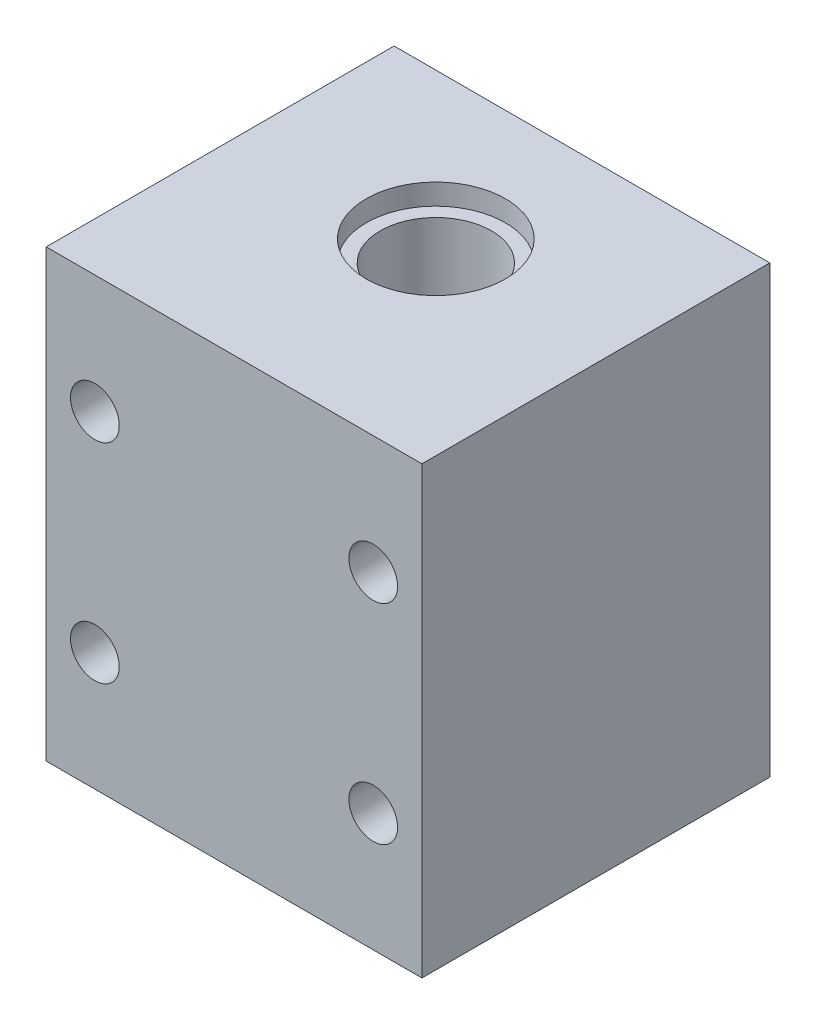
ISO-10303-21;
HEADER;
FILE_DESCRIPTION(('STEP AP214'),'2;1');
FILE_NAME('part.step','',(''),(''),'','','');
FILE_SCHEMA(('AUTOMOTIVE_DESIGN { 1 0 10303 214 1 1 1 1 }'));
ENDSEC;
DATA;
#1=APPLICATION_CONTEXT('core data for automotive mechanical design processes');
#2=APPLICATION_PROTOCOL_DEFINITION('international standard','automotive_design',2000,#1);
#3=PRODUCT_CONTEXT('',#1,'mechanical');
#4=PRODUCT('Part','Part','',(#3));
#5=PRODUCT_RELATED_PRODUCT_CATEGORY('part','',(#4));
#6=PRODUCT_DEFINITION_FORMATION('','',#4);
#7=PRODUCT_DEFINITION_CONTEXT('part definition',#1,'design');
#8=PRODUCT_DEFINITION('design','',#6,#7);
#9=PRODUCT_DEFINITION_SHAPE('','',#8);
#10=(LENGTH_UNIT() NAMED_UNIT(*) SI_UNIT(.MILLI.,.METRE.));
#11=(NAMED_UNIT(*) PLANE_ANGLE_UNIT() SI_UNIT($,.RADIAN.));
#12=(NAMED_UNIT(*) SI_UNIT($,.STERADIAN.) SOLID_ANGLE_UNIT());
#13=UNCERTAINTY_MEASURE_WITH_UNIT(LENGTH_MEASURE(1.E-05),#10,'distance_accuracy_value','');
#14=(GEOMETRIC_REPRESENTATION_CONTEXT(3) GLOBAL_UNCERTAINTY_ASSIGNED_CONTEXT((#13)) GLOBAL_UNIT_ASSIGNED_CONTEXT((#10,
#11,#12)) REPRESENTATION_CONTEXT('',''));
#15=CARTESIAN_POINT('',(0.,0.,0.));
#16=DIRECTION('',(0.,0.,1.));
#17=DIRECTION('',(1.,0.,0.));
#18=AXIS2_PLACEMENT_3D('',#15,#16,#17);
#19=CARTESIAN_POINT('',(0.,-16.,16.5));
#20=DIRECTION('',(0.,1.,0.));
#21=DIRECTION('',(0.,0.,1.));
#22=AXIS2_PLACEMENT_3D('',#19,#20,#21);
#23=CYLINDRICAL_SURFACE('',#22,4.);
#24=CARTESIAN_POINT('',(0.,14.5,16.5));
#25=DIRECTION('',(0.,1.,0.));
#26=DIRECTION('',(0.,0.,1.));
#27=AXIS2_PLACEMENT_3D('',#24,#25,#26);
#28=CIRCLE('',#27,4.);
#29=CARTESIAN_POINT('',(0.,14.5,20.5));
#30=VERTEX_POINT('',#29);
#31=EDGE_CURVE('E104',#30,#30,#28,.T.);
#32=ORIENTED_EDGE('',*,*,#31,.T.);
#33=EDGE_LOOP('',(#32));
#34=FACE_BOUND('',#33,.T.);
#35=CARTESIAN_POINT('',(0.,-14.5,16.5));
#36=DIRECTION('',(0.,-1.,0.));
#37=DIRECTION('',(0.,0.,-1.));
#38=AXIS2_PLACEMENT_3D('',#35,#36,#37);
#39=CIRCLE('',#38,4.);
#40=CARTESIAN_POINT('',(0.,-14.5,12.5));
#41=VERTEX_POINT('',#40);
#42=EDGE_CURVE('E38',#41,#41,#39,.F.);
#43=ORIENTED_EDGE('',*,*,#42,.F.);
#44=EDGE_LOOP('',(#43));
#45=FACE_BOUND('',#44,.T.);
#46=ADVANCED_FACE('F34',(#34,#45),#23,.F.);
#47=CARTESIAN_POINT('',(13.5,16.,31.));
#48=DIRECTION('',(-1.,0.,0.));
#49=DIRECTION('',(0.,-1.,0.));
#50=AXIS2_PLACEMENT_3D('',#47,#48,#49);
#51=PLANE('',#50);
#52=DIRECTION('',(0.,1.,0.));
#53=VECTOR('',#52,1.);
#54=CARTESIAN_POINT('',(13.5,-16.,6.));
#55=LINE('',#54,#53);
#56=CARTESIAN_POINT('',(13.5,-16.,6.));
#57=VERTEX_POINT('',#56);
#58=CARTESIAN_POINT('',(13.5,16.,6.));
#59=VERTEX_POINT('',#58);
#60=EDGE_CURVE('E51',#57,#59,#55,.T.);
#61=ORIENTED_EDGE('',*,*,#60,.T.);
#62=DIRECTION('',(0.,0.,-1.));
#63=VECTOR('',#62,1.);
#64=CARTESIAN_POINT('',(13.5,16.,31.));
#65=LINE('',#64,#63);
#66=CARTESIAN_POINT('',(13.5,16.,31.));
#67=VERTEX_POINT('',#66);
#68=EDGE_CURVE('E12',#67,#59,#65,.T.);
#69=ORIENTED_EDGE('',*,*,#68,.F.);
#70=DIRECTION('',(0.,1.,0.));
#71=VECTOR('',#70,1.);
#72=CARTESIAN_POINT('',(13.5,16.,31.));
#73=LINE('',#72,#71);
#74=CARTESIAN_POINT('',(13.5,-16.,31.));
#75=VERTEX_POINT('',#74);
#76=EDGE_CURVE('E148',#75,#67,#73,.T.);
#77=ORIENTED_EDGE('',*,*,#76,.F.);
#78=DIRECTION('',(0.,0.,-1.));
#79=VECTOR('',#78,1.);
#80=CARTESIAN_POINT('',(13.5,-16.,31.));
#81=LINE('',#80,#79);
#82=EDGE_CURVE('E96',#75,#57,#81,.T.);
#83=ORIENTED_EDGE('',*,*,#82,.T.);
#84=EDGE_LOOP('',(#61,#69,#77,#83));
#85=FACE_BOUND('',#84,.T.);
#86=ADVANCED_FACE('F36',(#85),#51,.F.);
#87=CARTESIAN_POINT('',(-13.5,16.,31.));
#88=DIRECTION('',(0.,-1.,0.));
#89=DIRECTION('',(0.,0.,-1.));
#90=AXIS2_PLACEMENT_3D('',#87,#88,#89);
#91=PLANE('',#90);
#92=CARTESIAN_POINT('',(0.,16.,16.5));
#93=DIRECTION('',(0.,1.,0.));
#94=DIRECTION('',(0.,0.,1.));
#95=AXIS2_PLACEMENT_3D('',#92,#93,#94);
#96=CIRCLE('',#95,5.);
#97=CARTESIAN_POINT('',(0.,16.,21.5));
#98=VERTEX_POINT('',#97);
#99=EDGE_CURVE('E106',#98,#98,#96,.T.);
#100=ORIENTED_EDGE('',*,*,#99,.F.);
#101=EDGE_LOOP('',(#100));
#102=FACE_BOUND('',#101,.T.);
#103=DIRECTION('',(-1.,0.,0.));
#104=VECTOR('',#103,1.);
#105=CARTESIAN_POINT('',(-13.5,16.,6.));
#106=LINE('',#105,#104);
#107=CARTESIAN_POINT('',(-13.5,16.,6.));
#108=VERTEX_POINT('',#107);
#109=EDGE_CURVE('E84',#59,#108,#106,.T.);
#110=ORIENTED_EDGE('',*,*,#109,.T.);
#111=DIRECTION('',(0.,0.,-1.));
#112=VECTOR('',#111,1.);
#113=CARTESIAN_POINT('',(-13.5,16.,31.));
#114=LINE('',#113,#112);
#115=CARTESIAN_POINT('',(-13.5,16.,31.));
#116=VERTEX_POINT('',#115);
#117=EDGE_CURVE('E43',#116,#108,#114,.T.);
#118=ORIENTED_EDGE('',*,*,#117,.F.);
#119=DIRECTION('',(-1.,0.,0.));
#120=VECTOR('',#119,1.);
#121=CARTESIAN_POINT('',(-13.5,16.,31.));
#122=LINE('',#121,#120);
#123=EDGE_CURVE('E150',#67,#116,#122,.T.);
#124=ORIENTED_EDGE('',*,*,#123,.F.);
#125=ORIENTED_EDGE('',*,*,#68,.T.);
#126=EDGE_LOOP('',(#110,#118,#124,#125));
#127=FACE_BOUND('',#126,.T.);
#128=ADVANCED_FACE('F157',(#102,#127),#91,.F.);
#129=CARTESIAN_POINT('',(-13.5,16.,31.));
#130=DIRECTION('',(1.,0.,0.));
#131=DIRECTION('',(0.,1.,0.));
#132=AXIS2_PLACEMENT_3D('',#129,#130,#131);
#133=PLANE('',#132);
#134=DIRECTION('',(0.,1.,0.));
#135=VECTOR('',#134,1.);
#136=CARTESIAN_POINT('',(-13.5,-16.,6.));
#137=LINE('',#136,#135);
#138=CARTESIAN_POINT('',(-13.5,-16.,6.));
#139=VERTEX_POINT('',#138);
#140=EDGE_CURVE('E79',#139,#108,#137,.T.);
#141=ORIENTED_EDGE('',*,*,#140,.F.);
#142=DIRECTION('',(0.,0.,-1.));
#143=VECTOR('',#142,1.);
#144=CARTESIAN_POINT('',(-13.5,-16.,31.));
#145=LINE('',#144,#143);
#146=CARTESIAN_POINT('',(-13.5,-16.,31.));
#147=VERTEX_POINT('',#146);
#148=EDGE_CURVE('E91',#147,#139,#145,.T.);
#149=ORIENTED_EDGE('',*,*,#148,.F.);
#150=DIRECTION('',(0.,-1.,0.));
#151=VECTOR('',#150,1.);
#152=CARTESIAN_POINT('',(-13.5,16.,31.));
#153=LINE('',#152,#151);
#154=EDGE_CURVE('E152',#116,#147,#153,.T.);
#155=ORIENTED_EDGE('',*,*,#154,.F.);
#156=ORIENTED_EDGE('',*,*,#117,.T.);
#157=EDGE_LOOP('',(#141,#149,#155,#156));
#158=FACE_BOUND('',#157,.T.);
#159=ADVANCED_FACE('F89',(#158),#133,.F.);
#160=CARTESIAN_POINT('',(-13.5,-16.,31.));
#161=DIRECTION('',(0.,1.,0.));
#162=DIRECTION('',(0.,0.,1.));
#163=AXIS2_PLACEMENT_3D('',#160,#161,#162);
#164=PLANE('',#163);
#165=CARTESIAN_POINT('',(0.,-16.,16.5));
#166=DIRECTION('',(0.,-1.,0.));
#167=DIRECTION('',(0.,0.,-1.));
#168=AXIS2_PLACEMENT_3D('',#165,#166,#167);
#169=CIRCLE('',#168,5.);
#170=CARTESIAN_POINT('',(0.,-16.,11.5));
#171=VERTEX_POINT('',#170);
#172=EDGE_CURVE('E117',#171,#171,#169,.T.);
#173=ORIENTED_EDGE('',*,*,#172,.F.);
#174=EDGE_LOOP('',(#173));
#175=FACE_BOUND('',#174,.T.);
#176=DIRECTION('',(-1.,0.,0.));
#177=VECTOR('',#176,1.);
#178=CARTESIAN_POINT('',(-13.5,-16.,6.));
#179=LINE('',#178,#177);
#180=EDGE_CURVE('E75',#57,#139,#179,.T.);
#181=ORIENTED_EDGE('',*,*,#180,.F.);
#182=ORIENTED_EDGE('',*,*,#82,.F.);
#183=DIRECTION('',(1.,0.,0.));
#184=VECTOR('',#183,1.);
#185=CARTESIAN_POINT('',(-13.5,-16.,31.));
#186=LINE('',#185,#184);
#187=EDGE_CURVE('E59',#147,#75,#186,.T.);
#188=ORIENTED_EDGE('',*,*,#187,.F.);
#189=ORIENTED_EDGE('',*,*,#148,.T.);
#190=EDGE_LOOP('',(#181,#182,#188,#189));
#191=FACE_BOUND('',#190,.T.);
#192=ADVANCED_FACE('F95',(#175,#191),#164,.F.);
#193=CARTESIAN_POINT('',(10.,7.5,31.));
#194=DIRECTION('',(0.,0.,-1.));
#195=DIRECTION('',(-1.,0.,0.));
#196=AXIS2_PLACEMENT_3D('',#193,#194,#195);
#197=CYLINDRICAL_SURFACE('',#196,1.75);
#198=CARTESIAN_POINT('',(10.,7.5,31.));
#199=DIRECTION('',(0.,0.,-1.));
#200=DIRECTION('',(-1.,0.,0.));
#201=AXIS2_PLACEMENT_3D('',#198,#199,#200);
#202=CIRCLE('',#201,1.75);
#203=CARTESIAN_POINT('',(8.25,7.5,31.));
#204=VERTEX_POINT('',#203);
#205=EDGE_CURVE('E140',#204,#204,#202,.T.);
#206=ORIENTED_EDGE('',*,*,#205,.F.);
#207=EDGE_LOOP('',(#206));
#208=FACE_BOUND('',#207,.T.);
#209=CARTESIAN_POINT('',(10.,7.5,6.));
#210=DIRECTION('',(0.,0.,-1.));
#211=DIRECTION('',(-1.,0.,0.));
#212=AXIS2_PLACEMENT_3D('',#209,#210,#211);
#213=CIRCLE('',#212,1.75);
#214=CARTESIAN_POINT('',(8.25,7.5,6.));
#215=VERTEX_POINT('',#214);
#216=EDGE_CURVE('E133',#215,#215,#213,.F.);
#217=ORIENTED_EDGE('',*,*,#216,.F.);
#218=EDGE_LOOP('',(#217));
#219=FACE_BOUND('',#218,.T.);
#220=ADVANCED_FACE('F188',(#208,#219),#197,.F.);
#221=CARTESIAN_POINT('',(-10.,7.5,31.));
#222=DIRECTION('',(0.,0.,-1.));
#223=DIRECTION('',(-1.,0.,0.));
#224=AXIS2_PLACEMENT_3D('',#221,#222,#223);
#225=CYLINDRICAL_SURFACE('',#224,1.75);
#226=CARTESIAN_POINT('',(-10.,7.5,31.));
#227=DIRECTION('',(0.,0.,-1.));
#228=DIRECTION('',(-1.,0.,0.));
#229=AXIS2_PLACEMENT_3D('',#226,#227,#228);
#230=CIRCLE('',#229,1.75);
#231=CARTESIAN_POINT('',(-11.75,7.5,31.));
#232=VERTEX_POINT('',#231);
#233=EDGE_CURVE('E137',#232,#232,#230,.T.);
#234=ORIENTED_EDGE('',*,*,#233,.F.);
#235=EDGE_LOOP('',(#234));
#236=FACE_BOUND('',#235,.T.);
#237=CARTESIAN_POINT('',(-10.,7.5,6.));
#238=DIRECTION('',(0.,0.,-1.));
#239=DIRECTION('',(-1.,0.,0.));
#240=AXIS2_PLACEMENT_3D('',#237,#238,#239);
#241=CIRCLE('',#240,1.75);
#242=CARTESIAN_POINT('',(-11.75,7.5,6.));
#243=VERTEX_POINT('',#242);
#244=EDGE_CURVE('E130',#243,#243,#241,.F.);
#245=ORIENTED_EDGE('',*,*,#244,.F.);
#246=EDGE_LOOP('',(#245));
#247=FACE_BOUND('',#246,.T.);
#248=ADVANCED_FACE('F184',(#236,#247),#225,.F.);
#249=CARTESIAN_POINT('',(-10.,-7.5,31.));
#250=DIRECTION('',(0.,0.,-1.));
#251=DIRECTION('',(-1.,0.,0.));
#252=AXIS2_PLACEMENT_3D('',#249,#250,#251);
#253=CYLINDRICAL_SURFACE('',#252,1.75);
#254=CARTESIAN_POINT('',(-10.,-7.5,31.));
#255=DIRECTION('',(0.,0.,-1.));
#256=DIRECTION('',(-1.,0.,0.));
#257=AXIS2_PLACEMENT_3D('',#254,#255,#256);
#258=CIRCLE('',#257,1.75);
#259=CARTESIAN_POINT('',(-11.75,-7.5,31.));
#260=VERTEX_POINT('',#259);
#261=EDGE_CURVE('E141',#260,#260,#258,.T.);
#262=ORIENTED_EDGE('',*,*,#261,.F.);
#263=EDGE_LOOP('',(#262));
#264=FACE_BOUND('',#263,.T.);
#265=CARTESIAN_POINT('',(-10.,-7.5,6.));
#266=DIRECTION('',(0.,0.,-1.));
#267=DIRECTION('',(-1.,0.,0.));
#268=AXIS2_PLACEMENT_3D('',#265,#266,#267);
#269=CIRCLE('',#268,1.75);
#270=CARTESIAN_POINT('',(-11.75,-7.5,6.));
#271=VERTEX_POINT('',#270);
#272=EDGE_CURVE('E103',#271,#271,#269,.F.);
#273=ORIENTED_EDGE('',*,*,#272,.F.);
#274=EDGE_LOOP('',(#273));
#275=FACE_BOUND('',#274,.T.);
#276=ADVANCED_FACE('F187',(#264,#275),#253,.F.);
#277=CARTESIAN_POINT('',(10.,-7.5,31.));
#278=DIRECTION('',(0.,0.,-1.));
#279=DIRECTION('',(-1.,0.,0.));
#280=AXIS2_PLACEMENT_3D('',#277,#278,#279);
#281=CYLINDRICAL_SURFACE('',#280,1.75);
#282=CARTESIAN_POINT('',(10.,-7.5,31.));
#283=DIRECTION('',(0.,0.,-1.));
#284=DIRECTION('',(-1.,0.,0.));
#285=AXIS2_PLACEMENT_3D('',#282,#283,#284);
#286=CIRCLE('',#285,1.75);
#287=CARTESIAN_POINT('',(8.25,-7.5,31.));
#288=VERTEX_POINT('',#287);
#289=EDGE_CURVE('E136',#288,#288,#286,.T.);
#290=ORIENTED_EDGE('',*,*,#289,.F.);
#291=EDGE_LOOP('',(#290));
#292=FACE_BOUND('',#291,.T.);
#293=CARTESIAN_POINT('',(10.,-7.5,6.));
#294=DIRECTION('',(0.,0.,-1.));
#295=DIRECTION('',(-1.,0.,0.));
#296=AXIS2_PLACEMENT_3D('',#293,#294,#295);
#297=CIRCLE('',#296,1.75);
#298=CARTESIAN_POINT('',(8.25,-7.5,6.));
#299=VERTEX_POINT('',#298);
#300=EDGE_CURVE('E93',#299,#299,#297,.F.);
#301=ORIENTED_EDGE('',*,*,#300,.F.);
#302=EDGE_LOOP('',(#301));
#303=FACE_BOUND('',#302,.T.);
#304=ADVANCED_FACE('F192',(#292,#303),#281,.F.);
#305=CARTESIAN_POINT('',(0.,0.,31.));
#306=DIRECTION('',(0.,0.,1.));
#307=DIRECTION('',(1.,0.,0.));
#308=AXIS2_PLACEMENT_3D('',#305,#306,#307);
#309=PLANE('',#308);
#310=ORIENTED_EDGE('',*,*,#289,.T.);
#311=EDGE_LOOP('',(#310));
#312=FACE_BOUND('',#311,.T.);
#313=ORIENTED_EDGE('',*,*,#261,.T.);
#314=EDGE_LOOP('',(#313));
#315=FACE_BOUND('',#314,.T.);
#316=ORIENTED_EDGE('',*,*,#233,.T.);
#317=EDGE_LOOP('',(#316));
#318=FACE_BOUND('',#317,.T.);
#319=ORIENTED_EDGE('',*,*,#205,.T.);
#320=EDGE_LOOP('',(#319));
#321=FACE_BOUND('',#320,.T.);
#322=ORIENTED_EDGE('',*,*,#76,.T.);
#323=ORIENTED_EDGE('',*,*,#123,.T.);
#324=ORIENTED_EDGE('',*,*,#154,.T.);
#325=ORIENTED_EDGE('',*,*,#187,.T.);
#326=EDGE_LOOP('',(#322,#323,#324,#325));
#327=FACE_BOUND('',#326,.T.);
#328=ADVANCED_FACE('F153',(#312,#315,#318,#321,#327),#309,.T.);
#329=CARTESIAN_POINT('',(-13.5,-16.,6.));
#330=DIRECTION('',(0.,0.,-1.));
#331=DIRECTION('',(-1.,0.,0.));
#332=AXIS2_PLACEMENT_3D('',#329,#330,#331);
#333=PLANE('',#332);
#334=ORIENTED_EDGE('',*,*,#109,.F.);
#335=ORIENTED_EDGE('',*,*,#60,.F.);
#336=ORIENTED_EDGE('',*,*,#180,.T.);
#337=ORIENTED_EDGE('',*,*,#140,.T.);
#338=EDGE_LOOP('',(#334,#335,#336,#337));
#339=FACE_BOUND('',#338,.T.);
#340=ORIENTED_EDGE('',*,*,#300,.T.);
#341=EDGE_LOOP('',(#340));
#342=FACE_BOUND('',#341,.T.);
#343=ORIENTED_EDGE('',*,*,#272,.T.);
#344=EDGE_LOOP('',(#343));
#345=FACE_BOUND('',#344,.T.);
#346=ORIENTED_EDGE('',*,*,#244,.T.);
#347=EDGE_LOOP('',(#346));
#348=FACE_BOUND('',#347,.T.);
#349=ORIENTED_EDGE('',*,*,#216,.T.);
#350=EDGE_LOOP('',(#349));
#351=FACE_BOUND('',#350,.T.);
#352=ADVANCED_FACE('F77',(#339,#342,#345,#348,#351),#333,.T.);
#353=CARTESIAN_POINT('',(0.,14.5,16.5));
#354=DIRECTION('',(0.,1.,0.));
#355=DIRECTION('',(0.,0.,1.));
#356=AXIS2_PLACEMENT_3D('',#353,#354,#355);
#357=CYLINDRICAL_SURFACE('',#356,5.);
#358=CARTESIAN_POINT('',(0.,14.5,16.5));
#359=DIRECTION('',(0.,1.,0.));
#360=DIRECTION('',(0.,0.,1.));
#361=AXIS2_PLACEMENT_3D('',#358,#359,#360);
#362=CIRCLE('',#361,5.);
#363=CARTESIAN_POINT('',(0.,14.5,21.5));
#364=VERTEX_POINT('',#363);
#365=EDGE_CURVE('E110',#364,#364,#362,.T.);
#366=ORIENTED_EDGE('',*,*,#365,.F.);
#367=EDGE_LOOP('',(#366));
#368=FACE_BOUND('',#367,.T.);
#369=ORIENTED_EDGE('',*,*,#99,.T.);
#370=EDGE_LOOP('',(#369));
#371=FACE_BOUND('',#370,.T.);
#372=ADVANCED_FACE('F177',(#368,#371),#357,.F.);
#373=CARTESIAN_POINT('',(0.,14.5,16.5));
#374=DIRECTION('',(0.,1.,0.));
#375=DIRECTION('',(0.,0.,1.));
#376=AXIS2_PLACEMENT_3D('',#373,#374,#375);
#377=PLANE('',#376);
#378=ORIENTED_EDGE('',*,*,#31,.F.);
#379=EDGE_LOOP('',(#378));
#380=FACE_BOUND('',#379,.T.);
#381=ORIENTED_EDGE('',*,*,#365,.T.);
#382=EDGE_LOOP('',(#381));
#383=FACE_BOUND('',#382,.T.);
#384=ADVANCED_FACE('F173',(#380,#383),#377,.T.);
#385=CARTESIAN_POINT('',(0.,-14.5,16.5));
#386=DIRECTION('',(0.,-1.,0.));
#387=DIRECTION('',(0.,0.,-1.));
#388=AXIS2_PLACEMENT_3D('',#385,#386,#387);
#389=PLANE('',#388);
#390=CARTESIAN_POINT('',(0.,-14.5,16.5));
#391=DIRECTION('',(0.,-1.,0.));
#392=DIRECTION('',(0.,0.,-1.));
#393=AXIS2_PLACEMENT_3D('',#390,#391,#392);
#394=CIRCLE('',#393,5.);
#395=CARTESIAN_POINT('',(0.,-14.5,11.5));
#396=VERTEX_POINT('',#395);
#397=EDGE_CURVE('E113',#396,#396,#394,.T.);
#398=ORIENTED_EDGE('',*,*,#397,.T.);
#399=EDGE_LOOP('',(#398));
#400=FACE_BOUND('',#399,.T.);
#401=ORIENTED_EDGE('',*,*,#42,.T.);
#402=EDGE_LOOP('',(#401));
#403=FACE_BOUND('',#402,.T.);
#404=ADVANCED_FACE('F176',(#400,#403),#389,.T.);
#405=CARTESIAN_POINT('',(0.,-14.5,16.5));
#406=DIRECTION('',(0.,-1.,0.));
#407=DIRECTION('',(0.,0.,-1.));
#408=AXIS2_PLACEMENT_3D('',#405,#406,#407);
#409=CYLINDRICAL_SURFACE('',#408,5.);
#410=ORIENTED_EDGE('',*,*,#397,.F.);
#411=EDGE_LOOP('',(#410));
#412=FACE_BOUND('',#411,.T.);
#413=ORIENTED_EDGE('',*,*,#172,.T.);
#414=EDGE_LOOP('',(#413));
#415=FACE_BOUND('',#414,.T.);
#416=ADVANCED_FACE('F171',(#412,#415),#409,.F.);
#417=CLOSED_SHELL('',(#46,#86,#128,#159,#192,#220,#248,#276,#304,#328,#352,#372,#384,#404,#416));
#418=MANIFOLD_SOLID_BREP('B2',#417);
#419=ADVANCED_BREP_SHAPE_REPRESENTATION('',(#18,#418),#14);
#420=SHAPE_DEFINITION_REPRESENTATION(#9,#419);
ENDSEC;
END-ISO-10303-21;
